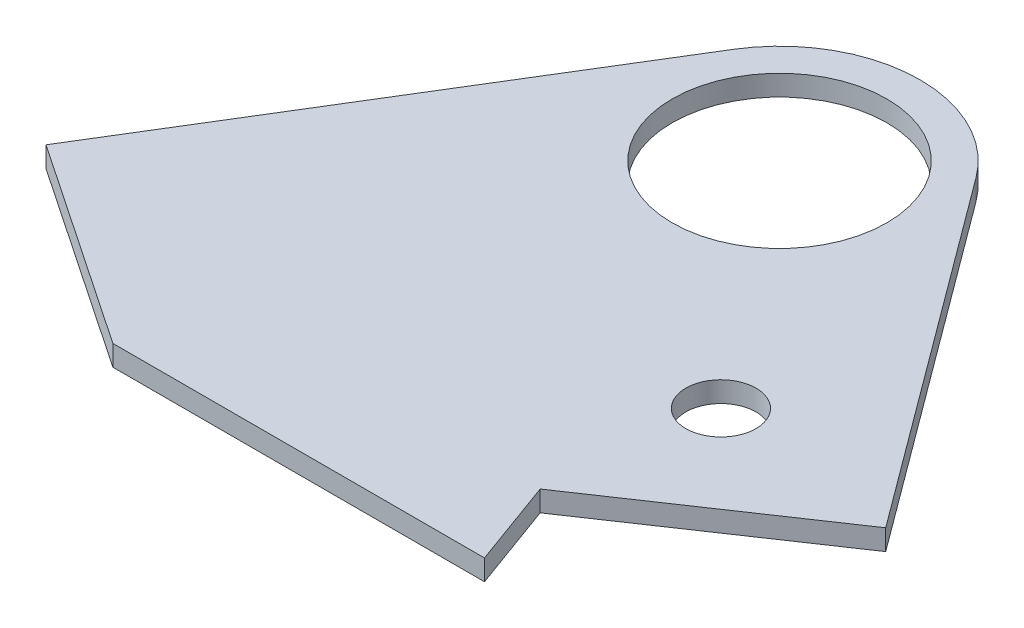
ISO-10303-21;
HEADER;
FILE_DESCRIPTION(('STEP AP214'),'2;1');
FILE_NAME('part.step','',(''),(''),'','','');
FILE_SCHEMA(('AUTOMOTIVE_DESIGN { 1 0 10303 214 1 1 1 1 }'));
ENDSEC;
DATA;
#1=APPLICATION_CONTEXT('core data for automotive mechanical design processes');
#2=APPLICATION_PROTOCOL_DEFINITION('international standard','automotive_design',2000,#1);
#3=PRODUCT_CONTEXT('',#1,'mechanical');
#4=PRODUCT('Part','Part','',(#3));
#5=PRODUCT_RELATED_PRODUCT_CATEGORY('part','',(#4));
#6=PRODUCT_DEFINITION_FORMATION('','',#4);
#7=PRODUCT_DEFINITION_CONTEXT('part definition',#1,'design');
#8=PRODUCT_DEFINITION('design','',#6,#7);
#9=PRODUCT_DEFINITION_SHAPE('','',#8);
#10=(LENGTH_UNIT() NAMED_UNIT(*) SI_UNIT(.MILLI.,.METRE.));
#11=(NAMED_UNIT(*) PLANE_ANGLE_UNIT() SI_UNIT($,.RADIAN.));
#12=(NAMED_UNIT(*) SI_UNIT($,.STERADIAN.) SOLID_ANGLE_UNIT());
#13=UNCERTAINTY_MEASURE_WITH_UNIT(LENGTH_MEASURE(1.E-05),#10,'distance_accuracy_value','');
#14=(GEOMETRIC_REPRESENTATION_CONTEXT(3) GLOBAL_UNCERTAINTY_ASSIGNED_CONTEXT((#13)) GLOBAL_UNIT_ASSIGNED_CONTEXT((#10,
#11,#12)) REPRESENTATION_CONTEXT('',''));
#15=CARTESIAN_POINT('',(0.,0.,0.));
#16=DIRECTION('',(0.,0.,1.));
#17=DIRECTION('',(1.,0.,0.));
#18=AXIS2_PLACEMENT_3D('',#15,#16,#17);
#19=CARTESIAN_POINT('',(-1.00000001335143E-07,1.25,-0.0165450777516313));
#20=DIRECTION('',(0.,-1.,0.));
#21=DIRECTION('',(0.,0.,-1.));
#22=AXIS2_PLACEMENT_3D('',#19,#20,#21);
#23=PLANE('',#22);
#24=DIRECTION('',(0.829037572555045,0.,0.559192903470742));
#25=VECTOR('',#24,1.);
#26=CARTESIAN_POINT('',(-21.2237837975572,1.25,59.5));
#27=LINE('',#26,#25);
#28=CARTESIAN_POINT('',(-46.0949109742086,1.25,42.7242128958777));
#29=VERTEX_POINT('',#28);
#30=CARTESIAN_POINT('',(-21.2237837975572,1.25,59.5));
#31=VERTEX_POINT('',#30);
#32=EDGE_CURVE('E143',#29,#31,#27,.T.);
#33=ORIENTED_EDGE('',*,*,#32,.T.);
#34=DIRECTION('',(1.,0.,0.));
#35=VECTOR('',#34,1.);
#36=CARTESIAN_POINT('',(-21.2237837975572,1.25,59.5));
#37=LINE('',#36,#35);
#38=CARTESIAN_POINT('',(23.7762162024428,1.25,59.5));
#39=VERTEX_POINT('',#38);
#40=EDGE_CURVE('E96',#31,#39,#37,.T.);
#41=ORIENTED_EDGE('',*,*,#40,.T.);
#42=DIRECTION('',(-0.342020143325673,0.,-0.939692620785907));
#43=VECTOR('',#42,1.);
#44=CARTESIAN_POINT('',(23.7762162024428,1.25,59.5));
#45=LINE('',#44,#43);
#46=CARTESIAN_POINT('',(19.918131719221,1.25,48.9));
#47=VERTEX_POINT('',#46);
#48=EDGE_CURVE('E155',#39,#47,#45,.T.);
#49=ORIENTED_EDGE('',*,*,#48,.T.);
#50=DIRECTION('',(0.829037572555041,0.,-0.559192903470748));
#51=VECTOR('',#50,1.);
#52=CARTESIAN_POINT('',(19.918131719221,1.25,48.9));
#53=LINE('',#52,#51);
#54=CARTESIAN_POINT('',(44.9050890257914,1.25,32.0460844867401));
#55=VERTEX_POINT('',#54);
#56=EDGE_CURVE('E112',#47,#55,#53,.T.);
#57=ORIENTED_EDGE('',*,*,#56,.T.);
#58=DIRECTION('',(-0.595216022487427,0.,-0.803565732578392));
#59=VECTOR('',#58,1.);
#60=CARTESIAN_POINT('',(13.6606173538327,1.25,-10.1352174600379));
#61=LINE('',#60,#59);
#62=CARTESIAN_POINT('',(13.6606173538327,1.25,-10.1352174600379));
#63=VERTEX_POINT('',#62);
#64=EDGE_CURVE('E106',#55,#63,#61,.T.);
#65=ORIENTED_EDGE('',*,*,#64,.T.);
#66=CARTESIAN_POINT('',(-1.00000001335143E-07,1.25,-0.0165450777516313));
#67=DIRECTION('',(0.,1.,0.));
#68=DIRECTION('',(0.,0.,-1.));
#69=AXIS2_PLACEMENT_3D('',#66,#67,#68);
#70=CIRCLE('',#69,17.);
#71=CARTESIAN_POINT('',(-14.4992271308449,1.25,-8.89192763333854));
#72=VERTEX_POINT('',#71);
#73=EDGE_CURVE('E110',#63,#72,#70,.T.);
#74=ORIENTED_EDGE('',*,*,#73,.T.);
#75=DIRECTION('',(-0.52208132679923,0.,0.852895707696759));
#76=VECTOR('',#75,1.);
#77=CARTESIAN_POINT('',(-46.0949109742086,1.25,42.7242128958777));
#78=LINE('',#77,#76);
#79=EDGE_CURVE('E56',#72,#29,#78,.T.);
#80=ORIENTED_EDGE('',*,*,#79,.T.);
#81=EDGE_LOOP('',(#33,#41,#49,#57,#65,#74,#80));
#82=FACE_BOUND('',#81,.T.);
#83=CARTESIAN_POINT('',(0.,1.25,0.));
#84=DIRECTION('',(0.,1.,0.));
#85=DIRECTION('',(0.,0.,1.));
#86=AXIS2_PLACEMENT_3D('',#83,#84,#85);
#87=CIRCLE('',#86,13.);
#88=CARTESIAN_POINT('',(0.,1.25,13.));
#89=VERTEX_POINT('',#88);
#90=EDGE_CURVE('E134',#89,#89,#87,.T.);
#91=ORIENTED_EDGE('',*,*,#90,.F.);
#92=EDGE_LOOP('',(#91));
#93=FACE_BOUND('',#92,.T.);
#94=CARTESIAN_POINT('',(22.4050890257914,1.25,29.5));
#95=DIRECTION('',(0.,1.,0.));
#96=DIRECTION('',(0.,0.,1.));
#97=AXIS2_PLACEMENT_3D('',#94,#95,#96);
#98=CIRCLE('',#97,4.25);
#99=CARTESIAN_POINT('',(22.4050890257914,1.25,33.75));
#100=VERTEX_POINT('',#99);
#101=EDGE_CURVE('E170',#100,#100,#98,.T.);
#102=ORIENTED_EDGE('',*,*,#101,.F.);
#103=EDGE_LOOP('',(#102));
#104=FACE_BOUND('',#103,.T.);
#105=ADVANCED_FACE('F39',(#82,#93,#104),#23,.F.);
#106=CARTESIAN_POINT('',(-1.00000001335143E-07,-1.25,-0.0165450777516313));
#107=DIRECTION('',(0.,-1.,0.));
#108=DIRECTION('',(0.,0.,-1.));
#109=AXIS2_PLACEMENT_3D('',#106,#107,#108);
#110=PLANE('',#109);
#111=CARTESIAN_POINT('',(0.,-1.25,0.));
#112=DIRECTION('',(0.,1.,0.));
#113=DIRECTION('',(0.,0.,1.));
#114=AXIS2_PLACEMENT_3D('',#111,#112,#113);
#115=CIRCLE('',#114,13.);
#116=CARTESIAN_POINT('',(0.,-1.25,13.));
#117=VERTEX_POINT('',#116);
#118=EDGE_CURVE('E167',#117,#117,#115,.T.);
#119=ORIENTED_EDGE('',*,*,#118,.T.);
#120=EDGE_LOOP('',(#119));
#121=FACE_BOUND('',#120,.T.);
#122=DIRECTION('',(0.829037572555045,0.,0.559192903470742));
#123=VECTOR('',#122,1.);
#124=CARTESIAN_POINT('',(-21.2237837975572,-1.25,59.5));
#125=LINE('',#124,#123);
#126=CARTESIAN_POINT('',(-46.0949109742086,-1.25,42.7242128958777));
#127=VERTEX_POINT('',#126);
#128=CARTESIAN_POINT('',(-21.2237837975572,-1.25,59.5));
#129=VERTEX_POINT('',#128);
#130=EDGE_CURVE('E130',#127,#129,#125,.T.);
#131=ORIENTED_EDGE('',*,*,#130,.F.);
#132=DIRECTION('',(-0.52208132679923,0.,0.852895707696759));
#133=VECTOR('',#132,1.);
#134=CARTESIAN_POINT('',(-46.0949109742086,-1.25,42.7242128958777));
#135=LINE('',#134,#133);
#136=CARTESIAN_POINT('',(-14.4992271308449,-1.25,-8.89192763333854));
#137=VERTEX_POINT('',#136);
#138=EDGE_CURVE('E88',#137,#127,#135,.T.);
#139=ORIENTED_EDGE('',*,*,#138,.F.);
#140=CARTESIAN_POINT('',(-1.00000001335143E-07,-1.25,-0.0165450777516313));
#141=DIRECTION('',(0.,1.,0.));
#142=DIRECTION('',(0.,0.,-1.));
#143=AXIS2_PLACEMENT_3D('',#140,#141,#142);
#144=CIRCLE('',#143,17.);
#145=CARTESIAN_POINT('',(13.6606173538327,-1.25,-10.1352174600379));
#146=VERTEX_POINT('',#145);
#147=EDGE_CURVE('E82',#146,#137,#144,.T.);
#148=ORIENTED_EDGE('',*,*,#147,.F.);
#149=DIRECTION('',(-0.595216022487427,0.,-0.803565732578392));
#150=VECTOR('',#149,1.);
#151=CARTESIAN_POINT('',(13.6606173538327,-1.25,-10.1352174600379));
#152=LINE('',#151,#150);
#153=CARTESIAN_POINT('',(44.9050890257914,-1.25,32.0460844867401));
#154=VERTEX_POINT('',#153);
#155=EDGE_CURVE('E120',#154,#146,#152,.T.);
#156=ORIENTED_EDGE('',*,*,#155,.F.);
#157=DIRECTION('',(0.829037572555041,0.,-0.559192903470748));
#158=VECTOR('',#157,1.);
#159=CARTESIAN_POINT('',(19.918131719221,-1.25,48.9));
#160=LINE('',#159,#158);
#161=CARTESIAN_POINT('',(19.918131719221,-1.25,48.9));
#162=VERTEX_POINT('',#161);
#163=EDGE_CURVE('E138',#162,#154,#160,.T.);
#164=ORIENTED_EDGE('',*,*,#163,.F.);
#165=DIRECTION('',(-0.342020143325673,0.,-0.939692620785907));
#166=VECTOR('',#165,1.);
#167=CARTESIAN_POINT('',(23.7762162024428,-1.25,59.5));
#168=LINE('',#167,#166);
#169=CARTESIAN_POINT('',(23.7762162024428,-1.25,59.5));
#170=VERTEX_POINT('',#169);
#171=EDGE_CURVE('E136',#170,#162,#168,.T.);
#172=ORIENTED_EDGE('',*,*,#171,.F.);
#173=DIRECTION('',(1.,0.,0.));
#174=VECTOR('',#173,1.);
#175=CARTESIAN_POINT('',(-21.2237837975572,-1.25,59.5));
#176=LINE('',#175,#174);
#177=EDGE_CURVE('E133',#129,#170,#176,.T.);
#178=ORIENTED_EDGE('',*,*,#177,.F.);
#179=EDGE_LOOP('',(#131,#139,#148,#156,#164,#172,#178));
#180=FACE_BOUND('',#179,.T.);
#181=CARTESIAN_POINT('',(22.4050890257914,-1.25,29.5));
#182=DIRECTION('',(0.,1.,0.));
#183=DIRECTION('',(0.,0.,1.));
#184=AXIS2_PLACEMENT_3D('',#181,#182,#183);
#185=CIRCLE('',#184,4.25);
#186=CARTESIAN_POINT('',(22.4050890257914,-1.25,33.75));
#187=VERTEX_POINT('',#186);
#188=EDGE_CURVE('E173',#187,#187,#185,.T.);
#189=ORIENTED_EDGE('',*,*,#188,.T.);
#190=EDGE_LOOP('',(#189));
#191=FACE_BOUND('',#190,.T.);
#192=ADVANCED_FACE('F159',(#121,#180,#191),#110,.T.);
#193=CARTESIAN_POINT('',(-21.2237837975572,1.25,59.5));
#194=DIRECTION('',(0.559192903470742,0.,-0.829037572555045));
#195=DIRECTION('',(-0.829037572555045,0.,-0.559192903470742));
#196=AXIS2_PLACEMENT_3D('',#193,#194,#195);
#197=PLANE('',#196);
#198=ORIENTED_EDGE('',*,*,#130,.T.);
#199=DIRECTION('',(0.,-1.,0.));
#200=VECTOR('',#199,1.);
#201=CARTESIAN_POINT('',(-21.2237837975572,1.25,59.5));
#202=LINE('',#201,#200);
#203=EDGE_CURVE('E11',#31,#129,#202,.T.);
#204=ORIENTED_EDGE('',*,*,#203,.F.);
#205=ORIENTED_EDGE('',*,*,#32,.F.);
#206=DIRECTION('',(0.,-1.,0.));
#207=VECTOR('',#206,1.);
#208=CARTESIAN_POINT('',(-46.0949109742086,1.25,42.7242128958777));
#209=LINE('',#208,#207);
#210=EDGE_CURVE('E126',#29,#127,#209,.T.);
#211=ORIENTED_EDGE('',*,*,#210,.T.);
#212=EDGE_LOOP('',(#198,#204,#205,#211));
#213=FACE_BOUND('',#212,.T.);
#214=ADVANCED_FACE('F41',(#213),#197,.F.);
#215=CARTESIAN_POINT('',(-21.2237837975572,1.25,59.5));
#216=DIRECTION('',(0.,0.,-1.));
#217=DIRECTION('',(-1.,0.,0.));
#218=AXIS2_PLACEMENT_3D('',#215,#216,#217);
#219=PLANE('',#218);
#220=ORIENTED_EDGE('',*,*,#177,.T.);
#221=DIRECTION('',(0.,-1.,0.));
#222=VECTOR('',#221,1.);
#223=CARTESIAN_POINT('',(23.7762162024428,1.25,59.5));
#224=LINE('',#223,#222);
#225=EDGE_CURVE('E48',#39,#170,#224,.T.);
#226=ORIENTED_EDGE('',*,*,#225,.F.);
#227=ORIENTED_EDGE('',*,*,#40,.F.);
#228=ORIENTED_EDGE('',*,*,#203,.T.);
#229=EDGE_LOOP('',(#220,#226,#227,#228));
#230=FACE_BOUND('',#229,.T.);
#231=ADVANCED_FACE('F203',(#230),#219,.F.);
#232=CARTESIAN_POINT('',(23.7762162024428,1.25,59.5));
#233=DIRECTION('',(-0.939692620785907,0.,0.342020143325673));
#234=DIRECTION('',(0.342020143325673,0.,0.939692620785907));
#235=AXIS2_PLACEMENT_3D('',#232,#233,#234);
#236=PLANE('',#235);
#237=ORIENTED_EDGE('',*,*,#171,.T.);
#238=DIRECTION('',(0.,-1.,0.));
#239=VECTOR('',#238,1.);
#240=CARTESIAN_POINT('',(19.918131719221,1.25,48.9));
#241=LINE('',#240,#239);
#242=EDGE_CURVE('E147',#47,#162,#241,.T.);
#243=ORIENTED_EDGE('',*,*,#242,.F.);
#244=ORIENTED_EDGE('',*,*,#48,.F.);
#245=ORIENTED_EDGE('',*,*,#225,.T.);
#246=EDGE_LOOP('',(#237,#243,#244,#245));
#247=FACE_BOUND('',#246,.T.);
#248=ADVANCED_FACE('F153',(#247),#236,.F.);
#249=CARTESIAN_POINT('',(19.918131719221,1.25,48.9));
#250=DIRECTION('',(-0.559192903470748,0.,-0.829037572555041));
#251=DIRECTION('',(-0.829037572555041,0.,0.559192903470748));
#252=AXIS2_PLACEMENT_3D('',#249,#250,#251);
#253=PLANE('',#252);
#254=ORIENTED_EDGE('',*,*,#163,.T.);
#255=DIRECTION('',(0.,-1.,0.));
#256=VECTOR('',#255,1.);
#257=CARTESIAN_POINT('',(44.9050890257914,1.25,32.0460844867401));
#258=LINE('',#257,#256);
#259=EDGE_CURVE('E121',#55,#154,#258,.T.);
#260=ORIENTED_EDGE('',*,*,#259,.F.);
#261=ORIENTED_EDGE('',*,*,#56,.F.);
#262=ORIENTED_EDGE('',*,*,#242,.T.);
#263=EDGE_LOOP('',(#254,#260,#261,#262));
#264=FACE_BOUND('',#263,.T.);
#265=ADVANCED_FACE('F162',(#264),#253,.F.);
#266=CARTESIAN_POINT('',(13.6606173538327,1.25,-10.1352174600379));
#267=DIRECTION('',(-0.803565732578392,0.,0.595216022487427));
#268=DIRECTION('',(0.595216022487427,0.,0.803565732578392));
#269=AXIS2_PLACEMENT_3D('',#266,#267,#268);
#270=PLANE('',#269);
#271=ORIENTED_EDGE('',*,*,#155,.T.);
#272=DIRECTION('',(0.,-1.,0.));
#273=VECTOR('',#272,1.);
#274=CARTESIAN_POINT('',(13.6606173538327,1.25,-10.1352174600379));
#275=LINE('',#274,#273);
#276=EDGE_CURVE('E117',#63,#146,#275,.T.);
#277=ORIENTED_EDGE('',*,*,#276,.F.);
#278=ORIENTED_EDGE('',*,*,#64,.F.);
#279=ORIENTED_EDGE('',*,*,#259,.T.);
#280=EDGE_LOOP('',(#271,#277,#278,#279));
#281=FACE_BOUND('',#280,.T.);
#282=ADVANCED_FACE('F118',(#281),#270,.F.);
#283=CARTESIAN_POINT('',(-1.00000001335143E-07,1.25,-0.0165450777516313));
#284=DIRECTION('',(0.,-1.,0.));
#285=DIRECTION('',(0.,0.,-1.));
#286=AXIS2_PLACEMENT_3D('',#283,#284,#285);
#287=CYLINDRICAL_SURFACE('',#286,17.);
#288=ORIENTED_EDGE('',*,*,#147,.T.);
#289=DIRECTION('',(0.,-1.,0.));
#290=VECTOR('',#289,1.);
#291=CARTESIAN_POINT('',(-14.4992271308449,1.25,-8.89192763333854));
#292=LINE('',#291,#290);
#293=EDGE_CURVE('E122',#72,#137,#292,.T.);
#294=ORIENTED_EDGE('',*,*,#293,.F.);
#295=ORIENTED_EDGE('',*,*,#73,.F.);
#296=ORIENTED_EDGE('',*,*,#276,.T.);
#297=EDGE_LOOP('',(#288,#294,#295,#296));
#298=FACE_BOUND('',#297,.T.);
#299=ADVANCED_FACE('F124',(#298),#287,.T.);
#300=CARTESIAN_POINT('',(-46.0949109742086,1.25,42.7242128958777));
#301=DIRECTION('',(0.852895707696759,0.,0.52208132679923));
#302=DIRECTION('',(0.52208132679923,0.,-0.852895707696759));
#303=AXIS2_PLACEMENT_3D('',#300,#301,#302);
#304=PLANE('',#303);
#305=ORIENTED_EDGE('',*,*,#138,.T.);
#306=ORIENTED_EDGE('',*,*,#210,.F.);
#307=ORIENTED_EDGE('',*,*,#79,.F.);
#308=ORIENTED_EDGE('',*,*,#293,.T.);
#309=EDGE_LOOP('',(#305,#306,#307,#308));
#310=FACE_BOUND('',#309,.T.);
#311=ADVANCED_FACE('F193',(#310),#304,.F.);
#312=CARTESIAN_POINT('',(0.,1.25,0.));
#313=DIRECTION('',(0.,-1.,0.));
#314=DIRECTION('',(0.,0.,-1.));
#315=AXIS2_PLACEMENT_3D('',#312,#313,#314);
#316=CYLINDRICAL_SURFACE('',#315,13.);
#317=ORIENTED_EDGE('',*,*,#90,.T.);
#318=EDGE_LOOP('',(#317));
#319=FACE_BOUND('',#318,.T.);
#320=ORIENTED_EDGE('',*,*,#118,.F.);
#321=EDGE_LOOP('',(#320));
#322=FACE_BOUND('',#321,.T.);
#323=ADVANCED_FACE('F190',(#319,#322),#316,.F.);
#324=CARTESIAN_POINT('',(22.4050890257914,1.25,29.5));
#325=DIRECTION('',(0.,-1.,0.));
#326=DIRECTION('',(0.,0.,-1.));
#327=AXIS2_PLACEMENT_3D('',#324,#325,#326);
#328=CYLINDRICAL_SURFACE('',#327,4.25);
#329=ORIENTED_EDGE('',*,*,#101,.T.);
#330=EDGE_LOOP('',(#329));
#331=FACE_BOUND('',#330,.T.);
#332=ORIENTED_EDGE('',*,*,#188,.F.);
#333=EDGE_LOOP('',(#332));
#334=FACE_BOUND('',#333,.T.);
#335=ADVANCED_FACE('F179',(#331,#334),#328,.F.);
#336=CLOSED_SHELL('',(#105,#192,#214,#231,#248,#265,#282,#299,#311,#323,#335));
#337=MANIFOLD_SOLID_BREP('B2',#336);
#338=ADVANCED_BREP_SHAPE_REPRESENTATION('',(#18,#337),#14);
#339=SHAPE_DEFINITION_REPRESENTATION(#9,#338);
ENDSEC;
END-ISO-10303-21;
